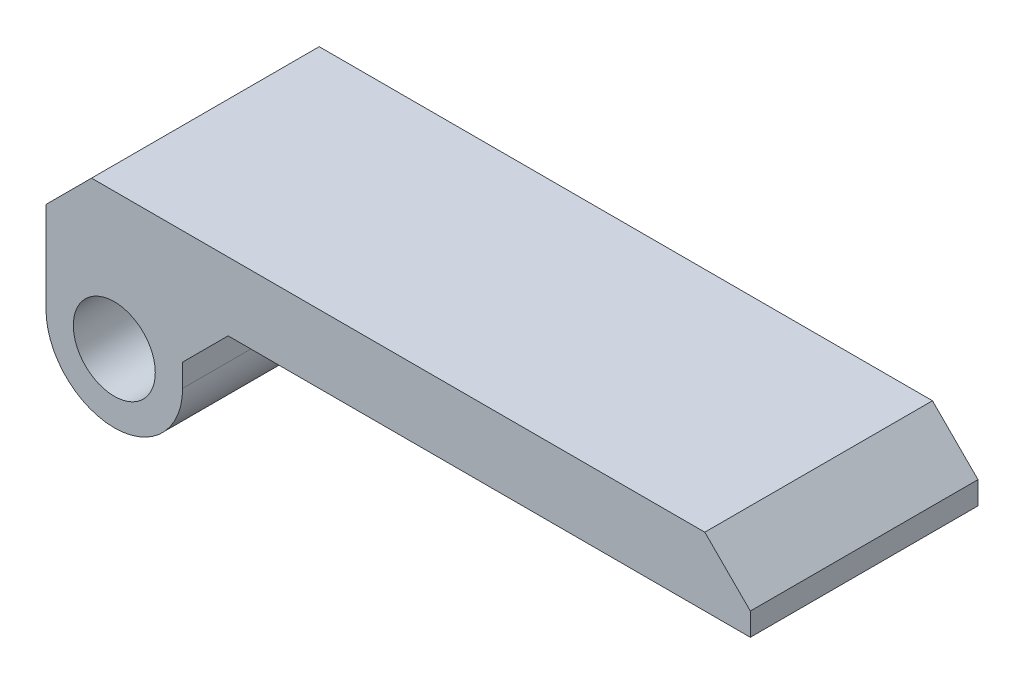
ISO-10303-21;
HEADER;
FILE_DESCRIPTION(('STEP AP214'),'2;1');
FILE_NAME('part.step','',(''),(''),'','','');
FILE_SCHEMA(('AUTOMOTIVE_DESIGN { 1 0 10303 214 1 1 1 1 }'));
ENDSEC;
DATA;
#1=APPLICATION_CONTEXT('core data for automotive mechanical design processes');
#2=APPLICATION_PROTOCOL_DEFINITION('international standard','automotive_design',2000,#1);
#3=PRODUCT_CONTEXT('',#1,'mechanical');
#4=PRODUCT('Part','Part','',(#3));
#5=PRODUCT_RELATED_PRODUCT_CATEGORY('part','',(#4));
#6=PRODUCT_DEFINITION_FORMATION('','',#4);
#7=PRODUCT_DEFINITION_CONTEXT('part definition',#1,'design');
#8=PRODUCT_DEFINITION('design','',#6,#7);
#9=PRODUCT_DEFINITION_SHAPE('','',#8);
#10=(LENGTH_UNIT() NAMED_UNIT(*) SI_UNIT(.MILLI.,.METRE.));
#11=(NAMED_UNIT(*) PLANE_ANGLE_UNIT() SI_UNIT($,.RADIAN.));
#12=(NAMED_UNIT(*) SI_UNIT($,.STERADIAN.) SOLID_ANGLE_UNIT());
#13=UNCERTAINTY_MEASURE_WITH_UNIT(LENGTH_MEASURE(1.E-05),#10,'distance_accuracy_value','');
#14=(GEOMETRIC_REPRESENTATION_CONTEXT(3) GLOBAL_UNCERTAINTY_ASSIGNED_CONTEXT((#13)) GLOBAL_UNIT_ASSIGNED_CONTEXT((#10,
#11,#12)) REPRESENTATION_CONTEXT('',''));
#15=CARTESIAN_POINT('',(0.,0.,0.));
#16=DIRECTION('',(0.,0.,1.));
#17=DIRECTION('',(1.,0.,0.));
#18=AXIS2_PLACEMENT_3D('',#15,#16,#17);
#19=CARTESIAN_POINT('',(0.,60.,37.));
#20=DIRECTION('',(0.,-1.,0.));
#21=DIRECTION('',(0.,0.,-1.));
#22=AXIS2_PLACEMENT_3D('',#19,#20,#21);
#23=PLANE('',#22);
#24=DIRECTION('',(0.,0.,1.));
#25=VECTOR('',#24,1.);
#26=CARTESIAN_POINT('',(32.8284271247462,60.,31.));
#27=LINE('',#26,#25);
#28=CARTESIAN_POINT('',(32.8284271247462,60.,31.));
#29=VERTEX_POINT('',#28);
#30=CARTESIAN_POINT('',(32.8284271247462,60.,33.));
#31=VERTEX_POINT('',#30);
#32=EDGE_CURVE('E156',#29,#31,#27,.T.);
#33=ORIENTED_EDGE('',*,*,#32,.F.);
#34=DIRECTION('',(-1.,0.,0.));
#35=VECTOR('',#34,1.);
#36=CARTESIAN_POINT('',(0.,60.,31.));
#37=LINE('',#36,#35);
#38=CARTESIAN_POINT('',(19.8284271247462,60.,31.));
#39=VERTEX_POINT('',#38);
#40=EDGE_CURVE('E142',#29,#39,#37,.T.);
#41=ORIENTED_EDGE('',*,*,#40,.T.);
#42=DIRECTION('',(0.,0.,-1.));
#43=VECTOR('',#42,1.);
#44=CARTESIAN_POINT('',(19.8284271247462,60.,27.));
#45=LINE('',#44,#43);
#46=CARTESIAN_POINT('',(19.8284271247462,60.,27.));
#47=VERTEX_POINT('',#46);
#48=EDGE_CURVE('E229',#39,#47,#45,.T.);
#49=ORIENTED_EDGE('',*,*,#48,.T.);
#50=DIRECTION('',(-1.,0.,0.));
#51=VECTOR('',#50,1.);
#52=CARTESIAN_POINT('',(0.,60.,27.));
#53=LINE('',#52,#51);
#54=CARTESIAN_POINT('',(42.7658088201775,60.,27.));
#55=VERTEX_POINT('',#54);
#56=EDGE_CURVE('E198',#55,#47,#53,.T.);
#57=ORIENTED_EDGE('',*,*,#56,.F.);
#58=DIRECTION('',(0.,0.,-1.));
#59=VECTOR('',#58,1.);
#60=CARTESIAN_POINT('',(42.7658088201775,60.,37.));
#61=LINE('',#60,#59);
#62=CARTESIAN_POINT('',(42.7658088201775,60.,37.));
#63=VERTEX_POINT('',#62);
#64=EDGE_CURVE('E209',#63,#55,#61,.T.);
#65=ORIENTED_EDGE('',*,*,#64,.F.);
#66=DIRECTION('',(-1.,0.,0.));
#67=VECTOR('',#66,1.);
#68=CARTESIAN_POINT('',(0.,60.,37.));
#69=LINE('',#68,#67);
#70=CARTESIAN_POINT('',(19.8284271247462,60.,37.));
#71=VERTEX_POINT('',#70);
#72=EDGE_CURVE('E180',#63,#71,#69,.T.);
#73=ORIENTED_EDGE('',*,*,#72,.T.);
#74=CARTESIAN_POINT('',(19.8284271247462,60.,33.));
#75=VERTEX_POINT('',#74);
#76=EDGE_CURVE('E230',#71,#75,#45,.T.);
#77=ORIENTED_EDGE('',*,*,#76,.T.);
#78=DIRECTION('',(-1.,0.,0.));
#79=VECTOR('',#78,1.);
#80=CARTESIAN_POINT('',(0.,60.,33.));
#81=LINE('',#80,#79);
#82=EDGE_CURVE('E54',#31,#75,#81,.T.);
#83=ORIENTED_EDGE('',*,*,#82,.F.);
#84=EDGE_LOOP('',(#33,#41,#49,#57,#65,#73,#77,#83));
#85=FACE_BOUND('',#84,.T.);
#86=ADVANCED_FACE('F39',(#85),#23,.T.);
#87=CARTESIAN_POINT('',(19.8284271247462,60.,37.));
#88=DIRECTION('',(0.707106781186544,-0.707106781186551,0.));
#89=DIRECTION('',(0.,0.,1.));
#90=AXIS2_PLACEMENT_3D('',#87,#88,#89);
#91=PLANE('',#90);
#92=DIRECTION('',(-0.707106781186551,-0.707106781186544,0.));
#93=VECTOR('',#92,1.);
#94=CARTESIAN_POINT('',(19.8284271247462,60.,31.));
#95=LINE('',#94,#93);
#96=CARTESIAN_POINT('',(17.8284271247462,58.,31.));
#97=VERTEX_POINT('',#96);
#98=EDGE_CURVE('E11',#97,#39,#95,.F.);
#99=ORIENTED_EDGE('',*,*,#98,.F.);
#100=DIRECTION('',(0.,0.,1.));
#101=VECTOR('',#100,1.);
#102=CARTESIAN_POINT('',(17.8284271247462,58.,37.));
#103=LINE('',#102,#101);
#104=CARTESIAN_POINT('',(17.8284271247462,58.,27.));
#105=VERTEX_POINT('',#104);
#106=EDGE_CURVE('E233',#105,#97,#103,.T.);
#107=ORIENTED_EDGE('',*,*,#106,.F.);
#108=DIRECTION('',(0.707106781186551,0.707106781186544,0.));
#109=VECTOR('',#108,1.);
#110=CARTESIAN_POINT('',(-20.085786437627,20.0857864376272,27.));
#111=LINE('',#110,#109);
#112=EDGE_CURVE('E239',#47,#105,#111,.F.);
#113=ORIENTED_EDGE('',*,*,#112,.F.);
#114=ORIENTED_EDGE('',*,*,#48,.F.);
#115=EDGE_LOOP('',(#99,#107,#113,#114));
#116=FACE_BOUND('',#115,.T.);
#117=ADVANCED_FACE('F275',(#116),#91,.T.);
#118=CARTESIAN_POINT('',(14.8284271247462,57.,37.));
#119=DIRECTION('',(0.,0.,-1.));
#120=DIRECTION('',(-1.,0.,0.));
#121=AXIS2_PLACEMENT_3D('',#118,#119,#120);
#122=CYLINDRICAL_SURFACE('',#121,3.);
#123=CARTESIAN_POINT('',(14.8284271247462,57.,27.));
#124=DIRECTION('',(0.,0.,1.));
#125=DIRECTION('',(1.,0.,0.));
#126=AXIS2_PLACEMENT_3D('',#123,#124,#125);
#127=CIRCLE('',#126,3.);
#128=CARTESIAN_POINT('',(11.8284271247462,57.,27.));
#129=VERTEX_POINT('',#128);
#130=CARTESIAN_POINT('',(17.8284271247462,57.,27.));
#131=VERTEX_POINT('',#130);
#132=EDGE_CURVE('E193',#129,#131,#127,.T.);
#133=ORIENTED_EDGE('',*,*,#132,.T.);
#134=DIRECTION('',(0.,0.,-1.));
#135=VECTOR('',#134,1.);
#136=CARTESIAN_POINT('',(17.8284271247462,57.,37.));
#137=LINE('',#136,#135);
#138=CARTESIAN_POINT('',(17.8284271247462,57.,37.));
#139=VERTEX_POINT('',#138);
#140=EDGE_CURVE('E212',#139,#131,#137,.T.);
#141=ORIENTED_EDGE('',*,*,#140,.F.);
#142=CARTESIAN_POINT('',(14.8284271247462,57.,37.));
#143=DIRECTION('',(0.,0.,1.));
#144=DIRECTION('',(1.,0.,0.));
#145=AXIS2_PLACEMENT_3D('',#142,#143,#144);
#146=CIRCLE('',#145,3.);
#147=CARTESIAN_POINT('',(11.8284271247462,57.,37.));
#148=VERTEX_POINT('',#147);
#149=EDGE_CURVE('E174',#148,#139,#146,.T.);
#150=ORIENTED_EDGE('',*,*,#149,.F.);
#151=DIRECTION('',(0.,0.,-1.));
#152=VECTOR('',#151,1.);
#153=CARTESIAN_POINT('',(11.8284271247462,57.,37.));
#154=LINE('',#153,#152);
#155=EDGE_CURVE('E190',#148,#129,#154,.T.);
#156=ORIENTED_EDGE('',*,*,#155,.T.);
#157=EDGE_LOOP('',(#133,#141,#150,#156));
#158=FACE_BOUND('',#157,.T.);
#159=ADVANCED_FACE('F296',(#158),#122,.T.);
#160=CARTESIAN_POINT('',(17.8284271247462,0.,37.));
#161=DIRECTION('',(1.,0.,0.));
#162=DIRECTION('',(0.,0.,-1.));
#163=AXIS2_PLACEMENT_3D('',#160,#161,#162);
#164=PLANE('',#163);
#165=DIRECTION('',(0.,-1.,0.));
#166=VECTOR('',#165,1.);
#167=CARTESIAN_POINT('',(17.8284271247462,0.,27.));
#168=LINE('',#167,#166);
#169=EDGE_CURVE('E196',#105,#131,#168,.T.);
#170=ORIENTED_EDGE('',*,*,#169,.F.);
#171=ORIENTED_EDGE('',*,*,#106,.T.);
#172=DIRECTION('',(0.,-1.,0.));
#173=VECTOR('',#172,1.);
#174=CARTESIAN_POINT('',(17.8284271247462,61.5,31.));
#175=LINE('',#174,#173);
#176=CARTESIAN_POINT('',(17.8284271247462,61.5,31.));
#177=VERTEX_POINT('',#176);
#178=EDGE_CURVE('E163',#177,#97,#175,.T.);
#179=ORIENTED_EDGE('',*,*,#178,.F.);
#180=DIRECTION('',(0.,0.,1.));
#181=VECTOR('',#180,1.);
#182=CARTESIAN_POINT('',(17.8284271247462,61.5,31.));
#183=LINE('',#182,#181);
#184=CARTESIAN_POINT('',(17.8284271247462,61.5,33.));
#185=VERTEX_POINT('',#184);
#186=EDGE_CURVE('E165',#177,#185,#183,.T.);
#187=ORIENTED_EDGE('',*,*,#186,.T.);
#188=DIRECTION('',(0.,-1.,0.));
#189=VECTOR('',#188,1.);
#190=CARTESIAN_POINT('',(17.8284271247462,61.5,33.));
#191=LINE('',#190,#189);
#192=CARTESIAN_POINT('',(17.8284271247462,58.,33.));
#193=VERTEX_POINT('',#192);
#194=EDGE_CURVE('E160',#185,#193,#191,.T.);
#195=ORIENTED_EDGE('',*,*,#194,.T.);
#196=CARTESIAN_POINT('',(17.8284271247462,58.,37.));
#197=VERTEX_POINT('',#196);
#198=EDGE_CURVE('E232',#193,#197,#103,.T.);
#199=ORIENTED_EDGE('',*,*,#198,.T.);
#200=DIRECTION('',(0.,-1.,0.));
#201=VECTOR('',#200,1.);
#202=CARTESIAN_POINT('',(17.8284271247462,0.,37.));
#203=LINE('',#202,#201);
#204=EDGE_CURVE('E178',#197,#139,#203,.T.);
#205=ORIENTED_EDGE('',*,*,#204,.T.);
#206=ORIENTED_EDGE('',*,*,#140,.T.);
#207=EDGE_LOOP('',(#170,#171,#179,#187,#195,#199,#205,#206));
#208=FACE_BOUND('',#207,.T.);
#209=ADVANCED_FACE('F260',(#208),#164,.T.);
#210=CARTESIAN_POINT('',(42.7658088201775,0.,37.));
#211=DIRECTION('',(1.,0.,0.));
#212=DIRECTION('',(0.,0.,-1.));
#213=AXIS2_PLACEMENT_3D('',#210,#211,#212);
#214=PLANE('',#213);
#215=DIRECTION('',(0.,-1.,0.));
#216=VECTOR('',#215,1.);
#217=CARTESIAN_POINT('',(42.7658088201775,0.,27.));
#218=LINE('',#217,#216);
#219=CARTESIAN_POINT('',(42.7658088201775,61.,27.));
#220=VERTEX_POINT('',#219);
#221=EDGE_CURVE('E201',#220,#55,#218,.T.);
#222=ORIENTED_EDGE('',*,*,#221,.F.);
#223=DIRECTION('',(0.,0.,1.));
#224=VECTOR('',#223,1.);
#225=CARTESIAN_POINT('',(42.7658088201775,61.,37.));
#226=LINE('',#225,#224);
#227=CARTESIAN_POINT('',(42.7658088201775,61.,37.));
#228=VERTEX_POINT('',#227);
#229=EDGE_CURVE('E224',#220,#228,#226,.T.);
#230=ORIENTED_EDGE('',*,*,#229,.T.);
#231=DIRECTION('',(0.,-1.,0.));
#232=VECTOR('',#231,1.);
#233=CARTESIAN_POINT('',(42.7658088201775,0.,37.));
#234=LINE('',#233,#232);
#235=EDGE_CURVE('E183',#228,#63,#234,.T.);
#236=ORIENTED_EDGE('',*,*,#235,.T.);
#237=ORIENTED_EDGE('',*,*,#64,.T.);
#238=EDGE_LOOP('',(#222,#230,#236,#237));
#239=FACE_BOUND('',#238,.T.);
#240=ADVANCED_FACE('F281',(#239),#214,.T.);
#241=CARTESIAN_POINT('',(0.,63.,37.));
#242=DIRECTION('',(0.,1.,0.));
#243=DIRECTION('',(0.,0.,1.));
#244=AXIS2_PLACEMENT_3D('',#241,#242,#243);
#245=PLANE('',#244);
#246=DIRECTION('',(1.,0.,0.));
#247=VECTOR('',#246,1.);
#248=CARTESIAN_POINT('',(0.,63.,37.));
#249=LINE('',#248,#247);
#250=CARTESIAN_POINT('',(13.8284271247462,63.,37.));
#251=VERTEX_POINT('',#250);
#252=CARTESIAN_POINT('',(40.7658088201775,63.,37.));
#253=VERTEX_POINT('',#252);
#254=EDGE_CURVE('E185',#251,#253,#249,.T.);
#255=ORIENTED_EDGE('',*,*,#254,.T.);
#256=DIRECTION('',(0.,0.,-1.));
#257=VECTOR('',#256,1.);
#258=CARTESIAN_POINT('',(40.7658088201775,63.,37.));
#259=LINE('',#258,#257);
#260=CARTESIAN_POINT('',(40.7658088201775,63.,27.));
#261=VERTEX_POINT('',#260);
#262=EDGE_CURVE('E217',#253,#261,#259,.T.);
#263=ORIENTED_EDGE('',*,*,#262,.T.);
#264=DIRECTION('',(1.,0.,0.));
#265=VECTOR('',#264,1.);
#266=CARTESIAN_POINT('',(0.,63.,27.));
#267=LINE('',#266,#265);
#268=CARTESIAN_POINT('',(13.8284271247462,63.,27.));
#269=VERTEX_POINT('',#268);
#270=EDGE_CURVE('E203',#269,#261,#267,.T.);
#271=ORIENTED_EDGE('',*,*,#270,.F.);
#272=DIRECTION('',(0.,0.,1.));
#273=VECTOR('',#272,1.);
#274=CARTESIAN_POINT('',(13.8284271247462,63.,37.));
#275=LINE('',#274,#273);
#276=EDGE_CURVE('E215',#269,#251,#275,.T.);
#277=ORIENTED_EDGE('',*,*,#276,.T.);
#278=EDGE_LOOP('',(#255,#263,#271,#277));
#279=FACE_BOUND('',#278,.T.);
#280=ADVANCED_FACE('F286',(#279),#245,.T.);
#281=CARTESIAN_POINT('',(14.8284271247462,57.,37.));
#282=DIRECTION('',(0.,0.,-1.));
#283=DIRECTION('',(-1.,0.,0.));
#284=AXIS2_PLACEMENT_3D('',#281,#282,#283);
#285=CYLINDRICAL_SURFACE('',#284,1.8);
#286=CARTESIAN_POINT('',(14.8284271247462,57.,37.));
#287=DIRECTION('',(0.,0.,1.));
#288=DIRECTION('',(1.,0.,0.));
#289=AXIS2_PLACEMENT_3D('',#286,#287,#288);
#290=CIRCLE('',#289,1.8);
#291=CARTESIAN_POINT('',(16.6284271247462,57.,37.));
#292=VERTEX_POINT('',#291);
#293=EDGE_CURVE('E171',#292,#292,#290,.T.);
#294=ORIENTED_EDGE('',*,*,#293,.T.);
#295=EDGE_LOOP('',(#294));
#296=FACE_BOUND('',#295,.T.);
#297=CARTESIAN_POINT('',(14.8284271247462,57.,27.));
#298=DIRECTION('',(0.,0.,1.));
#299=DIRECTION('',(1.,0.,0.));
#300=AXIS2_PLACEMENT_3D('',#297,#298,#299);
#301=CIRCLE('',#300,1.8);
#302=CARTESIAN_POINT('',(16.6284271247462,57.,27.));
#303=VERTEX_POINT('',#302);
#304=EDGE_CURVE('E151',#303,#303,#301,.T.);
#305=ORIENTED_EDGE('',*,*,#304,.F.);
#306=EDGE_LOOP('',(#305));
#307=FACE_BOUND('',#306,.T.);
#308=ADVANCED_FACE('F314',(#296,#307),#285,.F.);
#309=CARTESIAN_POINT('',(11.8284271247462,0.,37.));
#310=DIRECTION('',(-1.,0.,0.));
#311=DIRECTION('',(0.,0.,1.));
#312=AXIS2_PLACEMENT_3D('',#309,#310,#311);
#313=PLANE('',#312);
#314=DIRECTION('',(0.,1.,0.));
#315=VECTOR('',#314,1.);
#316=CARTESIAN_POINT('',(11.8284271247462,0.,37.));
#317=LINE('',#316,#315);
#318=CARTESIAN_POINT('',(11.8284271247462,61.,37.));
#319=VERTEX_POINT('',#318);
#320=EDGE_CURVE('E188',#148,#319,#317,.T.);
#321=ORIENTED_EDGE('',*,*,#320,.T.);
#322=DIRECTION('',(0.,0.,-1.));
#323=VECTOR('',#322,1.);
#324=CARTESIAN_POINT('',(11.8284271247462,61.,37.));
#325=LINE('',#324,#323);
#326=CARTESIAN_POINT('',(11.8284271247462,61.,27.));
#327=VERTEX_POINT('',#326);
#328=EDGE_CURVE('E236',#319,#327,#325,.T.);
#329=ORIENTED_EDGE('',*,*,#328,.T.);
#330=DIRECTION('',(0.,1.,0.));
#331=VECTOR('',#330,1.);
#332=CARTESIAN_POINT('',(11.8284271247462,0.,27.));
#333=LINE('',#332,#331);
#334=EDGE_CURVE('E175',#129,#327,#333,.T.);
#335=ORIENTED_EDGE('',*,*,#334,.F.);
#336=ORIENTED_EDGE('',*,*,#155,.F.);
#337=EDGE_LOOP('',(#321,#329,#335,#336));
#338=FACE_BOUND('',#337,.T.);
#339=ADVANCED_FACE('F293',(#338),#313,.T.);
#340=CARTESIAN_POINT('',(0.,0.,37.));
#341=DIRECTION('',(0.,0.,1.));
#342=DIRECTION('',(1.,0.,0.));
#343=AXIS2_PLACEMENT_3D('',#340,#341,#342);
#344=PLANE('',#343);
#345=ORIENTED_EDGE('',*,*,#293,.F.);
#346=EDGE_LOOP('',(#345));
#347=FACE_BOUND('',#346,.T.);
#348=ORIENTED_EDGE('',*,*,#235,.F.);
#349=DIRECTION('',(0.707106781186546,-0.707106781186549,0.));
#350=VECTOR('',#349,1.);
#351=CARTESIAN_POINT('',(51.8829044100888,51.8829044100886,37.));
#352=LINE('',#351,#350);
#353=EDGE_CURVE('E227',#228,#253,#352,.F.);
#354=ORIENTED_EDGE('',*,*,#353,.T.);
#355=ORIENTED_EDGE('',*,*,#254,.F.);
#356=DIRECTION('',(0.707106781186552,0.707106781186543,0.));
#357=VECTOR('',#356,1.);
#358=CARTESIAN_POINT('',(-24.585786437627,24.5857864376273,37.));
#359=LINE('',#358,#357);
#360=EDGE_CURVE('E62',#251,#319,#359,.F.);
#361=ORIENTED_EDGE('',*,*,#360,.T.);
#362=ORIENTED_EDGE('',*,*,#320,.F.);
#363=ORIENTED_EDGE('',*,*,#149,.T.);
#364=ORIENTED_EDGE('',*,*,#204,.F.);
#365=DIRECTION('',(-0.707106781186551,-0.707106781186544,0.));
#366=VECTOR('',#365,1.);
#367=CARTESIAN_POINT('',(19.8284271247462,60.,37.));
#368=LINE('',#367,#366);
#369=EDGE_CURVE('E241',#197,#71,#368,.F.);
#370=ORIENTED_EDGE('',*,*,#369,.T.);
#371=ORIENTED_EDGE('',*,*,#72,.F.);
#372=EDGE_LOOP('',(#348,#354,#355,#361,#362,#363,#364,#370,#371));
#373=FACE_BOUND('',#372,.T.);
#374=ADVANCED_FACE('F253',(#347,#373),#344,.T.);
#375=CARTESIAN_POINT('',(0.,0.,27.));
#376=DIRECTION('',(0.,0.,1.));
#377=DIRECTION('',(1.,0.,0.));
#378=AXIS2_PLACEMENT_3D('',#375,#376,#377);
#379=PLANE('',#378);
#380=ORIENTED_EDGE('',*,*,#304,.T.);
#381=EDGE_LOOP('',(#380));
#382=FACE_BOUND('',#381,.T.);
#383=ORIENTED_EDGE('',*,*,#270,.T.);
#384=DIRECTION('',(-0.707106781186546,0.707106781186549,0.));
#385=VECTOR('',#384,1.);
#386=CARTESIAN_POINT('',(40.7658088201775,63.,27.));
#387=LINE('',#386,#385);
#388=EDGE_CURVE('E222',#261,#220,#387,.F.);
#389=ORIENTED_EDGE('',*,*,#388,.T.);
#390=ORIENTED_EDGE('',*,*,#221,.T.);
#391=ORIENTED_EDGE('',*,*,#56,.T.);
#392=ORIENTED_EDGE('',*,*,#112,.T.);
#393=ORIENTED_EDGE('',*,*,#169,.T.);
#394=ORIENTED_EDGE('',*,*,#132,.F.);
#395=ORIENTED_EDGE('',*,*,#334,.T.);
#396=DIRECTION('',(-0.707106781186552,-0.707106781186543,0.));
#397=VECTOR('',#396,1.);
#398=CARTESIAN_POINT('',(11.8284271247462,61.,27.));
#399=LINE('',#398,#397);
#400=EDGE_CURVE('E220',#327,#269,#399,.F.);
#401=ORIENTED_EDGE('',*,*,#400,.T.);
#402=EDGE_LOOP('',(#383,#389,#390,#391,#392,#393,#394,#395,#401));
#403=FACE_BOUND('',#402,.T.);
#404=ADVANCED_FACE('F277',(#382,#403),#379,.F.);
#405=CARTESIAN_POINT('',(40.7658088201775,63.,37.));
#406=DIRECTION('',(-0.707106781186549,-0.707106781186546,0.));
#407=DIRECTION('',(0.,0.,-1.));
#408=AXIS2_PLACEMENT_3D('',#405,#406,#407);
#409=PLANE('',#408);
#410=ORIENTED_EDGE('',*,*,#353,.F.);
#411=ORIENTED_EDGE('',*,*,#229,.F.);
#412=ORIENTED_EDGE('',*,*,#388,.F.);
#413=ORIENTED_EDGE('',*,*,#262,.F.);
#414=EDGE_LOOP('',(#410,#411,#412,#413));
#415=FACE_BOUND('',#414,.T.);
#416=ADVANCED_FACE('F283',(#415),#409,.F.);
#417=ORIENTED_EDGE('',*,*,#198,.F.);
#418=DIRECTION('',(-0.707106781186551,-0.707106781186544,0.));
#419=VECTOR('',#418,1.);
#420=CARTESIAN_POINT('',(19.8284271247462,60.,33.));
#421=LINE('',#420,#419);
#422=EDGE_CURVE('E47',#193,#75,#421,.F.);
#423=ORIENTED_EDGE('',*,*,#422,.T.);
#424=ORIENTED_EDGE('',*,*,#76,.F.);
#425=ORIENTED_EDGE('',*,*,#369,.F.);
#426=EDGE_LOOP('',(#417,#423,#424,#425));
#427=FACE_BOUND('',#426,.T.);
#428=ADVANCED_FACE('F245',(#427),#91,.T.);
#429=CARTESIAN_POINT('',(11.8284271247462,61.,37.));
#430=DIRECTION('',(0.707106781186543,-0.707106781186552,0.));
#431=DIRECTION('',(0.,0.,-1.));
#432=AXIS2_PLACEMENT_3D('',#429,#430,#431);
#433=PLANE('',#432);
#434=ORIENTED_EDGE('',*,*,#360,.F.);
#435=ORIENTED_EDGE('',*,*,#276,.F.);
#436=ORIENTED_EDGE('',*,*,#400,.F.);
#437=ORIENTED_EDGE('',*,*,#328,.F.);
#438=EDGE_LOOP('',(#434,#435,#436,#437));
#439=FACE_BOUND('',#438,.T.);
#440=ADVANCED_FACE('F41',(#439),#433,.F.);
#441=CARTESIAN_POINT('',(32.8284271247462,61.5,31.));
#442=DIRECTION('',(0.,1.,0.));
#443=DIRECTION('',(-1.,0.,0.));
#444=AXIS2_PLACEMENT_3D('',#441,#442,#443);
#445=PLANE('',#444);
#446=DIRECTION('',(-1.,0.,0.));
#447=VECTOR('',#446,1.);
#448=CARTESIAN_POINT('',(32.8284271247462,61.5,33.));
#449=LINE('',#448,#447);
#450=CARTESIAN_POINT('',(32.8284271247462,61.5,33.));
#451=VERTEX_POINT('',#450);
#452=EDGE_CURVE('E264',#451,#185,#449,.T.);
#453=ORIENTED_EDGE('',*,*,#452,.T.);
#454=ORIENTED_EDGE('',*,*,#186,.F.);
#455=DIRECTION('',(-1.,0.,0.));
#456=VECTOR('',#455,1.);
#457=CARTESIAN_POINT('',(32.8284271247462,61.5,31.));
#458=LINE('',#457,#456);
#459=CARTESIAN_POINT('',(32.8284271247462,61.5,31.));
#460=VERTEX_POINT('',#459);
#461=EDGE_CURVE('E159',#460,#177,#458,.T.);
#462=ORIENTED_EDGE('',*,*,#461,.F.);
#463=DIRECTION('',(0.,0.,1.));
#464=VECTOR('',#463,1.);
#465=CARTESIAN_POINT('',(32.8284271247462,61.5,31.));
#466=LINE('',#465,#464);
#467=EDGE_CURVE('E157',#460,#451,#466,.T.);
#468=ORIENTED_EDGE('',*,*,#467,.T.);
#469=EDGE_LOOP('',(#453,#454,#462,#468));
#470=FACE_BOUND('',#469,.T.);
#471=ADVANCED_FACE('F271',(#470),#445,.F.);
#472=CARTESIAN_POINT('',(32.8284271247462,60.,31.));
#473=DIRECTION('',(1.,0.,0.));
#474=DIRECTION('',(0.,0.,-1.));
#475=AXIS2_PLACEMENT_3D('',#472,#473,#474);
#476=PLANE('',#475);
#477=DIRECTION('',(0.,1.,0.));
#478=VECTOR('',#477,1.);
#479=CARTESIAN_POINT('',(32.8284271247462,60.,33.));
#480=LINE('',#479,#478);
#481=EDGE_CURVE('E266',#31,#451,#480,.T.);
#482=ORIENTED_EDGE('',*,*,#481,.T.);
#483=ORIENTED_EDGE('',*,*,#467,.F.);
#484=DIRECTION('',(0.,1.,0.));
#485=VECTOR('',#484,1.);
#486=CARTESIAN_POINT('',(32.8284271247462,60.,31.));
#487=LINE('',#486,#485);
#488=EDGE_CURVE('E146',#29,#460,#487,.T.);
#489=ORIENTED_EDGE('',*,*,#488,.F.);
#490=ORIENTED_EDGE('',*,*,#32,.T.);
#491=EDGE_LOOP('',(#482,#483,#489,#490));
#492=FACE_BOUND('',#491,.T.);
#493=ADVANCED_FACE('F155',(#492),#476,.F.);
#494=CARTESIAN_POINT('',(0.,0.,31.));
#495=DIRECTION('',(0.,0.,1.));
#496=DIRECTION('',(1.,0.,0.));
#497=AXIS2_PLACEMENT_3D('',#494,#495,#496);
#498=PLANE('',#497);
#499=ORIENTED_EDGE('',*,*,#488,.T.);
#500=ORIENTED_EDGE('',*,*,#461,.T.);
#501=ORIENTED_EDGE('',*,*,#178,.T.);
#502=ORIENTED_EDGE('',*,*,#98,.T.);
#503=ORIENTED_EDGE('',*,*,#40,.F.);
#504=EDGE_LOOP('',(#499,#500,#501,#502,#503));
#505=FACE_BOUND('',#504,.T.);
#506=ADVANCED_FACE('F144',(#505),#498,.T.);
#507=CARTESIAN_POINT('',(0.,0.,33.));
#508=DIRECTION('',(0.,0.,1.));
#509=DIRECTION('',(1.,0.,0.));
#510=AXIS2_PLACEMENT_3D('',#507,#508,#509);
#511=PLANE('',#510);
#512=ORIENTED_EDGE('',*,*,#82,.T.);
#513=ORIENTED_EDGE('',*,*,#422,.F.);
#514=ORIENTED_EDGE('',*,*,#194,.F.);
#515=ORIENTED_EDGE('',*,*,#452,.F.);
#516=ORIENTED_EDGE('',*,*,#481,.F.);
#517=EDGE_LOOP('',(#512,#513,#514,#515,#516));
#518=FACE_BOUND('',#517,.T.);
#519=ADVANCED_FACE('F327',(#518),#511,.F.);
#520=CLOSED_SHELL('',(#86,#117,#159,#209,#240,#280,#308,#339,#374,#404,#416,#428,#440,#471,#493,
#506,#519));
#521=MANIFOLD_SOLID_BREP('B2',#520);
#522=ADVANCED_BREP_SHAPE_REPRESENTATION('',(#18,#521),#14);
#523=SHAPE_DEFINITION_REPRESENTATION(#9,#522);
ENDSEC;
END-ISO-10303-21;
